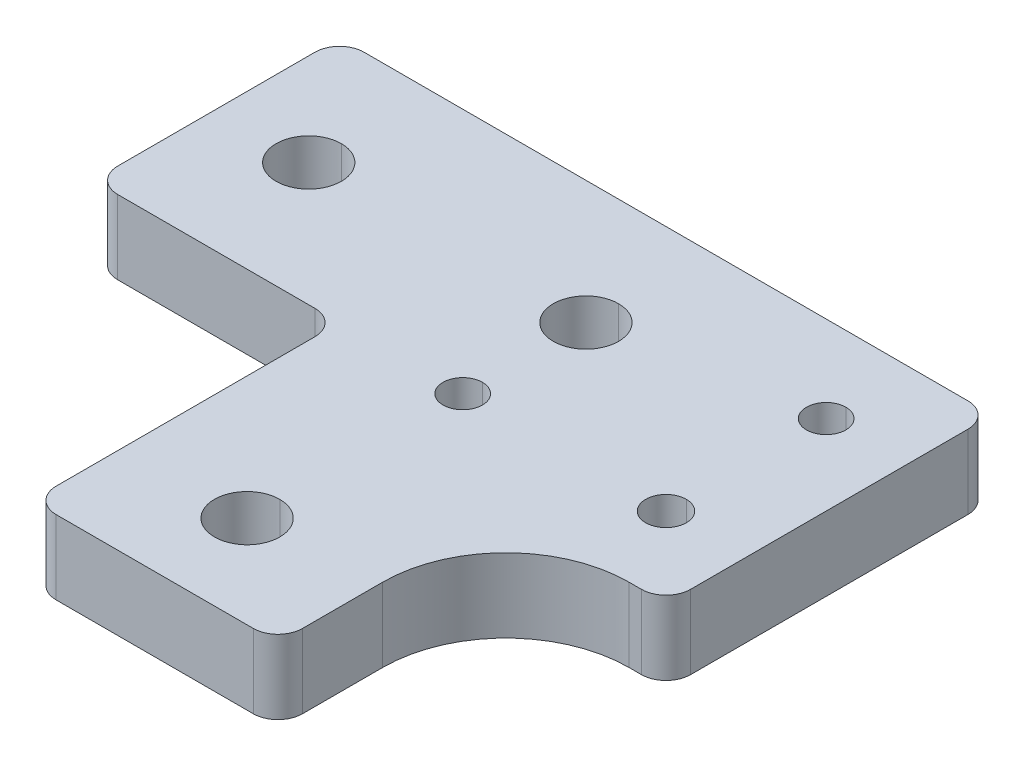
ISO-10303-21;
HEADER;
FILE_DESCRIPTION(('STEP AP214'),'2;1');
FILE_NAME('part.step','',(''),(''),'','','');
FILE_SCHEMA(('AUTOMOTIVE_DESIGN { 1 0 10303 214 1 1 1 1 }'));
ENDSEC;
DATA;
#1=APPLICATION_CONTEXT('core data for automotive mechanical design processes');
#2=APPLICATION_PROTOCOL_DEFINITION('international standard','automotive_design',2000,#1);
#3=PRODUCT_CONTEXT('',#1,'mechanical');
#4=PRODUCT('Part','Part','',(#3));
#5=PRODUCT_RELATED_PRODUCT_CATEGORY('part','',(#4));
#6=PRODUCT_DEFINITION_FORMATION('','',#4);
#7=PRODUCT_DEFINITION_CONTEXT('part definition',#1,'design');
#8=PRODUCT_DEFINITION('design','',#6,#7);
#9=PRODUCT_DEFINITION_SHAPE('','',#8);
#10=(LENGTH_UNIT() NAMED_UNIT(*) SI_UNIT(.MILLI.,.METRE.));
#11=(NAMED_UNIT(*) PLANE_ANGLE_UNIT() SI_UNIT($,.RADIAN.));
#12=(NAMED_UNIT(*) SI_UNIT($,.STERADIAN.) SOLID_ANGLE_UNIT());
#13=UNCERTAINTY_MEASURE_WITH_UNIT(LENGTH_MEASURE(1.E-05),#10,'distance_accuracy_value','');
#14=(GEOMETRIC_REPRESENTATION_CONTEXT(3) GLOBAL_UNCERTAINTY_ASSIGNED_CONTEXT((#13)) GLOBAL_UNIT_ASSIGNED_CONTEXT((#10,
#11,#12)) REPRESENTATION_CONTEXT('',''));
#15=CARTESIAN_POINT('',(0.,0.,0.));
#16=DIRECTION('',(0.,0.,1.));
#17=DIRECTION('',(1.,0.,0.));
#18=AXIS2_PLACEMENT_3D('',#15,#16,#17);
#19=CARTESIAN_POINT('',(99.5,6.,20.));
#20=DIRECTION('',(0.,1.,0.));
#21=DIRECTION('',(0.,0.,1.));
#22=AXIS2_PLACEMENT_3D('',#19,#20,#21);
#23=CYLINDRICAL_SURFACE('',#22,1.65);
#24=CARTESIAN_POINT('',(99.5,0.,20.));
#25=DIRECTION('',(0.,-1.,0.));
#26=DIRECTION('',(0.,0.,1.));
#27=AXIS2_PLACEMENT_3D('',#24,#25,#26);
#28=CIRCLE('',#27,1.65);
#29=CARTESIAN_POINT('',(99.5,0.,21.65));
#30=VERTEX_POINT('',#29);
#31=CARTESIAN_POINT('',(99.5,0.,18.35));
#32=VERTEX_POINT('',#31);
#33=EDGE_CURVE('E12',#30,#32,#28,.T.);
#34=ORIENTED_EDGE('',*,*,#33,.T.);
#35=DIRECTION('',(0.,1.,0.));
#36=VECTOR('',#35,1.);
#37=CARTESIAN_POINT('',(99.5,6.,18.35));
#38=LINE('',#37,#36);
#39=CARTESIAN_POINT('',(99.5,6.,18.35));
#40=VERTEX_POINT('',#39);
#41=EDGE_CURVE('E31',#32,#40,#38,.T.);
#42=ORIENTED_EDGE('',*,*,#41,.T.);
#43=CARTESIAN_POINT('',(99.5,6.,20.));
#44=DIRECTION('',(0.,-1.,0.));
#45=DIRECTION('',(0.,0.,1.));
#46=AXIS2_PLACEMENT_3D('',#43,#44,#45);
#47=CIRCLE('',#46,1.65);
#48=CARTESIAN_POINT('',(99.5,6.,21.65));
#49=VERTEX_POINT('',#48);
#50=EDGE_CURVE('E473',#49,#40,#47,.T.);
#51=ORIENTED_EDGE('',*,*,#50,.F.);
#52=DIRECTION('',(0.,1.,0.));
#53=VECTOR('',#52,1.);
#54=CARTESIAN_POINT('',(99.5,6.,21.65));
#55=LINE('',#54,#53);
#56=EDGE_CURVE('E411',#30,#49,#55,.T.);
#57=ORIENTED_EDGE('',*,*,#56,.F.);
#58=EDGE_LOOP('',(#34,#42,#51,#57));
#59=FACE_BOUND('',#58,.T.);
#60=ADVANCED_FACE('F20',(#59),#23,.F.);
#61=CARTESIAN_POINT('',(99.5,6.,7.));
#62=DIRECTION('',(0.,1.,0.));
#63=DIRECTION('',(0.,0.,1.));
#64=AXIS2_PLACEMENT_3D('',#61,#62,#63);
#65=CYLINDRICAL_SURFACE('',#64,1.6);
#66=CARTESIAN_POINT('',(99.5,0.,7.));
#67=DIRECTION('',(0.,-1.,0.));
#68=DIRECTION('',(0.,0.,1.));
#69=AXIS2_PLACEMENT_3D('',#66,#67,#68);
#70=CIRCLE('',#69,1.6);
#71=CARTESIAN_POINT('',(99.5,0.,8.6));
#72=VERTEX_POINT('',#71);
#73=CARTESIAN_POINT('',(99.5,0.,5.4));
#74=VERTEX_POINT('',#73);
#75=EDGE_CURVE('E438',#72,#74,#70,.T.);
#76=ORIENTED_EDGE('',*,*,#75,.T.);
#77=DIRECTION('',(0.,1.,0.));
#78=VECTOR('',#77,1.);
#79=CARTESIAN_POINT('',(99.5,6.,5.4));
#80=LINE('',#79,#78);
#81=CARTESIAN_POINT('',(99.5,6.,5.4));
#82=VERTEX_POINT('',#81);
#83=EDGE_CURVE('E387',#74,#82,#80,.T.);
#84=ORIENTED_EDGE('',*,*,#83,.T.);
#85=CARTESIAN_POINT('',(99.5,6.,7.));
#86=DIRECTION('',(0.,-1.,0.));
#87=DIRECTION('',(0.,0.,1.));
#88=AXIS2_PLACEMENT_3D('',#85,#86,#87);
#89=CIRCLE('',#88,1.6);
#90=CARTESIAN_POINT('',(99.5,6.,8.6));
#91=VERTEX_POINT('',#90);
#92=EDGE_CURVE('E532',#91,#82,#89,.T.);
#93=ORIENTED_EDGE('',*,*,#92,.F.);
#94=DIRECTION('',(0.,1.,0.));
#95=VECTOR('',#94,1.);
#96=CARTESIAN_POINT('',(99.5,6.,8.6));
#97=LINE('',#96,#95);
#98=EDGE_CURVE('E291',#72,#91,#97,.T.);
#99=ORIENTED_EDGE('',*,*,#98,.F.);
#100=EDGE_LOOP('',(#76,#84,#93,#99));
#101=FACE_BOUND('',#100,.T.);
#102=ADVANCED_FACE('F1234',(#101),#65,.F.);
#103=CARTESIAN_POINT('',(83.,6.,20.));
#104=DIRECTION('',(0.,1.,0.));
#105=DIRECTION('',(0.,0.,1.));
#106=AXIS2_PLACEMENT_3D('',#103,#104,#105);
#107=CYLINDRICAL_SURFACE('',#106,1.6);
#108=CARTESIAN_POINT('',(83.,0.,20.));
#109=DIRECTION('',(0.,-1.,0.));
#110=DIRECTION('',(0.,0.,1.));
#111=AXIS2_PLACEMENT_3D('',#108,#109,#110);
#112=CIRCLE('',#111,1.6);
#113=CARTESIAN_POINT('',(83.,0.,21.6));
#114=VERTEX_POINT('',#113);
#115=CARTESIAN_POINT('',(83.,0.,18.4));
#116=VERTEX_POINT('',#115);
#117=EDGE_CURVE('E382',#114,#116,#112,.T.);
#118=ORIENTED_EDGE('',*,*,#117,.T.);
#119=DIRECTION('',(0.,1.,0.));
#120=VECTOR('',#119,1.);
#121=CARTESIAN_POINT('',(83.,6.,18.4));
#122=LINE('',#121,#120);
#123=CARTESIAN_POINT('',(83.,6.,18.4));
#124=VERTEX_POINT('',#123);
#125=EDGE_CURVE('E388',#116,#124,#122,.T.);
#126=ORIENTED_EDGE('',*,*,#125,.T.);
#127=CARTESIAN_POINT('',(83.,6.,20.));
#128=DIRECTION('',(0.,-1.,0.));
#129=DIRECTION('',(0.,0.,1.));
#130=AXIS2_PLACEMENT_3D('',#127,#128,#129);
#131=CIRCLE('',#130,1.6);
#132=CARTESIAN_POINT('',(83.,6.,21.6));
#133=VERTEX_POINT('',#132);
#134=EDGE_CURVE('E579',#133,#124,#131,.T.);
#135=ORIENTED_EDGE('',*,*,#134,.F.);
#136=DIRECTION('',(0.,1.,0.));
#137=VECTOR('',#136,1.);
#138=CARTESIAN_POINT('',(83.,6.,21.6));
#139=LINE('',#138,#137);
#140=EDGE_CURVE('E517',#114,#133,#139,.T.);
#141=ORIENTED_EDGE('',*,*,#140,.F.);
#142=EDGE_LOOP('',(#118,#126,#135,#141));
#143=FACE_BOUND('',#142,.T.);
#144=ADVANCED_FACE('F1238',(#143),#107,.F.);
#145=CARTESIAN_POINT('',(83.,6.,37.5));
#146=DIRECTION('',(0.,-1.,0.));
#147=DIRECTION('',(0.,0.,-1.));
#148=AXIS2_PLACEMENT_3D('',#145,#146,#147);
#149=CYLINDRICAL_SURFACE('',#148,2.65);
#150=CARTESIAN_POINT('',(83.,6.,37.5));
#151=DIRECTION('',(0.,-1.,0.));
#152=DIRECTION('',(0.,0.,1.));
#153=AXIS2_PLACEMENT_3D('',#150,#151,#152);
#154=CIRCLE('',#153,2.65);
#155=CARTESIAN_POINT('',(83.,6.,40.15));
#156=VERTEX_POINT('',#155);
#157=CARTESIAN_POINT('',(83.,6.,34.85));
#158=VERTEX_POINT('',#157);
#159=EDGE_CURVE('E400',#156,#158,#154,.T.);
#160=ORIENTED_EDGE('',*,*,#159,.F.);
#161=DIRECTION('',(0.,-1.,0.));
#162=VECTOR('',#161,1.);
#163=CARTESIAN_POINT('',(83.,6.,40.15));
#164=LINE('',#163,#162);
#165=CARTESIAN_POINT('',(83.,0.,40.15));
#166=VERTEX_POINT('',#165);
#167=EDGE_CURVE('E378',#156,#166,#164,.T.);
#168=ORIENTED_EDGE('',*,*,#167,.T.);
#169=CARTESIAN_POINT('',(83.,0.,37.5));
#170=DIRECTION('',(0.,-1.,0.));
#171=DIRECTION('',(0.,0.,1.));
#172=AXIS2_PLACEMENT_3D('',#169,#170,#171);
#173=CIRCLE('',#172,2.65);
#174=CARTESIAN_POINT('',(83.,0.,34.85));
#175=VERTEX_POINT('',#174);
#176=EDGE_CURVE('E372',#166,#175,#173,.T.);
#177=ORIENTED_EDGE('',*,*,#176,.T.);
#178=DIRECTION('',(0.,-1.,0.));
#179=VECTOR('',#178,1.);
#180=CARTESIAN_POINT('',(83.,6.,34.85));
#181=LINE('',#180,#179);
#182=EDGE_CURVE('E361',#158,#175,#181,.T.);
#183=ORIENTED_EDGE('',*,*,#182,.F.);
#184=EDGE_LOOP('',(#160,#168,#177,#183));
#185=FACE_BOUND('',#184,.T.);
#186=ADVANCED_FACE('F22',(#185),#149,.F.);
#187=CARTESIAN_POINT('',(60.5,6.,10.));
#188=DIRECTION('',(0.,-1.,0.));
#189=DIRECTION('',(0.,0.,-1.));
#190=AXIS2_PLACEMENT_3D('',#187,#188,#189);
#191=CYLINDRICAL_SURFACE('',#190,2.65);
#192=CARTESIAN_POINT('',(60.5,6.,10.));
#193=DIRECTION('',(0.,-1.,0.));
#194=DIRECTION('',(0.,0.,1.));
#195=AXIS2_PLACEMENT_3D('',#192,#193,#194);
#196=CIRCLE('',#195,2.65);
#197=CARTESIAN_POINT('',(60.5,6.,12.65));
#198=VERTEX_POINT('',#197);
#199=CARTESIAN_POINT('',(60.5,6.,7.35));
#200=VERTEX_POINT('',#199);
#201=EDGE_CURVE('E585',#198,#200,#196,.T.);
#202=ORIENTED_EDGE('',*,*,#201,.F.);
#203=DIRECTION('',(0.,-1.,0.));
#204=VECTOR('',#203,1.);
#205=CARTESIAN_POINT('',(60.5,6.,12.65));
#206=LINE('',#205,#204);
#207=CARTESIAN_POINT('',(60.5,0.,12.65));
#208=VERTEX_POINT('',#207);
#209=EDGE_CURVE('E379',#198,#208,#206,.T.);
#210=ORIENTED_EDGE('',*,*,#209,.T.);
#211=CARTESIAN_POINT('',(60.5,0.,10.));
#212=DIRECTION('',(0.,-1.,0.));
#213=DIRECTION('',(0.,0.,1.));
#214=AXIS2_PLACEMENT_3D('',#211,#212,#213);
#215=CIRCLE('',#214,2.65);
#216=CARTESIAN_POINT('',(60.5,0.,7.35));
#217=VERTEX_POINT('',#216);
#218=EDGE_CURVE('E420',#208,#217,#215,.T.);
#219=ORIENTED_EDGE('',*,*,#218,.T.);
#220=DIRECTION('',(0.,-1.,0.));
#221=VECTOR('',#220,1.);
#222=CARTESIAN_POINT('',(60.5,6.,7.35));
#223=LINE('',#222,#221);
#224=EDGE_CURVE('E360',#200,#217,#223,.T.);
#225=ORIENTED_EDGE('',*,*,#224,.F.);
#226=EDGE_LOOP('',(#202,#210,#219,#225));
#227=FACE_BOUND('',#226,.T.);
#228=ADVANCED_FACE('F1216',(#227),#191,.F.);
#229=CARTESIAN_POINT('',(83.,6.,10.));
#230=DIRECTION('',(0.,-1.,0.));
#231=DIRECTION('',(0.,0.,-1.));
#232=AXIS2_PLACEMENT_3D('',#229,#230,#231);
#233=CYLINDRICAL_SURFACE('',#232,2.65);
#234=CARTESIAN_POINT('',(83.,6.,10.));
#235=DIRECTION('',(0.,-1.,0.));
#236=DIRECTION('',(0.,0.,1.));
#237=AXIS2_PLACEMENT_3D('',#234,#235,#236);
#238=CIRCLE('',#237,2.65);
#239=CARTESIAN_POINT('',(83.,6.,12.65));
#240=VERTEX_POINT('',#239);
#241=CARTESIAN_POINT('',(83.,6.,7.35));
#242=VERTEX_POINT('',#241);
#243=EDGE_CURVE('E551',#240,#242,#238,.T.);
#244=ORIENTED_EDGE('',*,*,#243,.F.);
#245=DIRECTION('',(0.,-1.,0.));
#246=VECTOR('',#245,1.);
#247=CARTESIAN_POINT('',(83.,6.,12.65));
#248=LINE('',#247,#246);
#249=CARTESIAN_POINT('',(83.,0.,12.65));
#250=VERTEX_POINT('',#249);
#251=EDGE_CURVE('E439',#240,#250,#248,.T.);
#252=ORIENTED_EDGE('',*,*,#251,.T.);
#253=CARTESIAN_POINT('',(83.,0.,10.));
#254=DIRECTION('',(0.,-1.,0.));
#255=DIRECTION('',(0.,0.,1.));
#256=AXIS2_PLACEMENT_3D('',#253,#254,#255);
#257=CIRCLE('',#256,2.65);
#258=CARTESIAN_POINT('',(83.,0.,7.35));
#259=VERTEX_POINT('',#258);
#260=EDGE_CURVE('E477',#250,#259,#257,.T.);
#261=ORIENTED_EDGE('',*,*,#260,.T.);
#262=DIRECTION('',(0.,-1.,0.));
#263=VECTOR('',#262,1.);
#264=CARTESIAN_POINT('',(83.,6.,7.35));
#265=LINE('',#264,#263);
#266=EDGE_CURVE('E468',#242,#259,#265,.T.);
#267=ORIENTED_EDGE('',*,*,#266,.F.);
#268=EDGE_LOOP('',(#244,#252,#261,#267));
#269=FACE_BOUND('',#268,.T.);
#270=ADVANCED_FACE('F1211',(#269),#233,.F.);
#271=CARTESIAN_POINT('',(106.,6.,0.));
#272=DIRECTION('',(0.,-1.,0.));
#273=DIRECTION('',(0.,0.,-1.));
#274=AXIS2_PLACEMENT_3D('',#271,#272,#273);
#275=PLANE('',#274);
#276=DIRECTION('',(1.,0.,0.));
#277=VECTOR('',#276,1.);
#278=CARTESIAN_POINT('',(106.,6.,0.));
#279=LINE('',#278,#277);
#280=CARTESIAN_POINT('',(55.,6.,0.));
#281=VERTEX_POINT('',#280);
#282=CARTESIAN_POINT('',(104.,6.,0.));
#283=VERTEX_POINT('',#282);
#284=EDGE_CURVE('E462',#281,#283,#279,.T.);
#285=ORIENTED_EDGE('',*,*,#284,.F.);
#286=CARTESIAN_POINT('',(55.,6.,2.));
#287=DIRECTION('',(0.,-1.,0.));
#288=DIRECTION('',(0.,0.,-1.));
#289=AXIS2_PLACEMENT_3D('',#286,#287,#288);
#290=CIRCLE('',#289,2.);
#291=CARTESIAN_POINT('',(53.,6.,2.));
#292=VERTEX_POINT('',#291);
#293=EDGE_CURVE('E330',#292,#281,#290,.T.);
#294=ORIENTED_EDGE('',*,*,#293,.F.);
#295=DIRECTION('',(0.,0.,-1.));
#296=VECTOR('',#295,1.);
#297=CARTESIAN_POINT('',(53.,6.,0.));
#298=LINE('',#297,#296);
#299=CARTESIAN_POINT('',(53.,6.,18.));
#300=VERTEX_POINT('',#299);
#301=EDGE_CURVE('E467',#300,#292,#298,.T.);
#302=ORIENTED_EDGE('',*,*,#301,.F.);
#303=CARTESIAN_POINT('',(55.,6.,18.));
#304=DIRECTION('',(0.,-1.,0.));
#305=DIRECTION('',(0.,0.,-1.));
#306=AXIS2_PLACEMENT_3D('',#303,#304,#305);
#307=CIRCLE('',#306,2.);
#308=CARTESIAN_POINT('',(55.,6.,20.));
#309=VERTEX_POINT('',#308);
#310=EDGE_CURVE('E479',#309,#300,#307,.T.);
#311=ORIENTED_EDGE('',*,*,#310,.F.);
#312=DIRECTION('',(-1.,0.,0.));
#313=VECTOR('',#312,1.);
#314=CARTESIAN_POINT('',(53.,6.,20.));
#315=LINE('',#314,#313);
#316=CARTESIAN_POINT('',(71.,6.,20.));
#317=VERTEX_POINT('',#316);
#318=EDGE_CURVE('E433',#317,#309,#315,.T.);
#319=ORIENTED_EDGE('',*,*,#318,.F.);
#320=CARTESIAN_POINT('',(71.,6.,22.));
#321=DIRECTION('',(0.,1.,0.));
#322=DIRECTION('',(0.,0.,-1.));
#323=AXIS2_PLACEMENT_3D('',#320,#321,#322);
#324=CIRCLE('',#323,2.);
#325=CARTESIAN_POINT('',(73.,6.,22.));
#326=VERTEX_POINT('',#325);
#327=EDGE_CURVE('E427',#326,#317,#324,.T.);
#328=ORIENTED_EDGE('',*,*,#327,.F.);
#329=DIRECTION('',(0.,0.,-1.));
#330=VECTOR('',#329,1.);
#331=CARTESIAN_POINT('',(73.,6.,20.));
#332=LINE('',#331,#330);
#333=CARTESIAN_POINT('',(73.,6.,43.));
#334=VERTEX_POINT('',#333);
#335=EDGE_CURVE('E428',#334,#326,#332,.T.);
#336=ORIENTED_EDGE('',*,*,#335,.F.);
#337=CARTESIAN_POINT('',(75.,6.,43.));
#338=DIRECTION('',(0.,-1.,0.));
#339=DIRECTION('',(0.,0.,-1.));
#340=AXIS2_PLACEMENT_3D('',#337,#338,#339);
#341=CIRCLE('',#340,2.);
#342=CARTESIAN_POINT('',(75.,6.,45.));
#343=VERTEX_POINT('',#342);
#344=EDGE_CURVE('E491',#343,#334,#341,.T.);
#345=ORIENTED_EDGE('',*,*,#344,.F.);
#346=DIRECTION('',(-1.,0.,0.));
#347=VECTOR('',#346,1.);
#348=CARTESIAN_POINT('',(93.,6.,45.));
#349=LINE('',#348,#347);
#350=CARTESIAN_POINT('',(91.,6.,45.));
#351=VERTEX_POINT('',#350);
#352=EDGE_CURVE('E432',#351,#343,#349,.T.);
#353=ORIENTED_EDGE('',*,*,#352,.F.);
#354=CARTESIAN_POINT('',(91.,6.,43.));
#355=DIRECTION('',(0.,-1.,0.));
#356=DIRECTION('',(0.,0.,-1.));
#357=AXIS2_PLACEMENT_3D('',#354,#355,#356);
#358=CIRCLE('',#357,2.);
#359=CARTESIAN_POINT('',(93.,6.,43.));
#360=VERTEX_POINT('',#359);
#361=EDGE_CURVE('E324',#360,#351,#358,.T.);
#362=ORIENTED_EDGE('',*,*,#361,.F.);
#363=DIRECTION('',(0.,0.,1.));
#364=VECTOR('',#363,1.);
#365=CARTESIAN_POINT('',(93.,6.,26.5));
#366=LINE('',#365,#364);
#367=CARTESIAN_POINT('',(93.,6.,36.5));
#368=VERTEX_POINT('',#367);
#369=EDGE_CURVE('E285',#368,#360,#366,.T.);
#370=ORIENTED_EDGE('',*,*,#369,.F.);
#371=CARTESIAN_POINT('',(103.,6.,36.5));
#372=DIRECTION('',(0.,1.,0.));
#373=DIRECTION('',(0.,0.,-1.));
#374=AXIS2_PLACEMENT_3D('',#371,#372,#373);
#375=CIRCLE('',#374,10.);
#376=CARTESIAN_POINT('',(103.,6.,26.5));
#377=VERTEX_POINT('',#376);
#378=EDGE_CURVE('E277',#377,#368,#375,.T.);
#379=ORIENTED_EDGE('',*,*,#378,.F.);
#380=DIRECTION('',(-1.,0.,0.));
#381=VECTOR('',#380,1.);
#382=CARTESIAN_POINT('',(106.,6.,26.5));
#383=LINE('',#382,#381);
#384=CARTESIAN_POINT('',(104.,6.,26.5));
#385=VERTEX_POINT('',#384);
#386=EDGE_CURVE('E282',#385,#377,#383,.T.);
#387=ORIENTED_EDGE('',*,*,#386,.F.);
#388=CARTESIAN_POINT('',(104.,6.,24.5));
#389=DIRECTION('',(0.,-1.,0.));
#390=DIRECTION('',(0.,0.,-1.));
#391=AXIS2_PLACEMENT_3D('',#388,#389,#390);
#392=CIRCLE('',#391,2.);
#393=CARTESIAN_POINT('',(106.,6.,24.5));
#394=VERTEX_POINT('',#393);
#395=EDGE_CURVE('E497',#394,#385,#392,.T.);
#396=ORIENTED_EDGE('',*,*,#395,.F.);
#397=DIRECTION('',(0.,0.,1.));
#398=VECTOR('',#397,1.);
#399=CARTESIAN_POINT('',(106.,6.,26.5));
#400=LINE('',#399,#398);
#401=CARTESIAN_POINT('',(106.,6.,2.));
#402=VERTEX_POINT('',#401);
#403=EDGE_CURVE('E301',#402,#394,#400,.T.);
#404=ORIENTED_EDGE('',*,*,#403,.F.);
#405=CARTESIAN_POINT('',(104.,6.,2.));
#406=DIRECTION('',(0.,-1.,0.));
#407=DIRECTION('',(0.,0.,-1.));
#408=AXIS2_PLACEMENT_3D('',#405,#406,#407);
#409=CIRCLE('',#408,2.);
#410=EDGE_CURVE('E307',#283,#402,#409,.T.);
#411=ORIENTED_EDGE('',*,*,#410,.F.);
#412=EDGE_LOOP('',(#285,#294,#302,#311,#319,#328,#336,#345,#353,#362,#370,#379,#387,#396,#404,#411));
#413=FACE_BOUND('',#412,.T.);
#414=ORIENTED_EDGE('',*,*,#50,.T.);
#415=CARTESIAN_POINT('',(99.5,6.,20.));
#416=DIRECTION('',(0.,-1.,0.));
#417=DIRECTION('',(0.,0.,1.));
#418=AXIS2_PLACEMENT_3D('',#415,#416,#417);
#419=CIRCLE('',#418,1.65);
#420=EDGE_CURVE('E478',#40,#49,#419,.T.);
#421=ORIENTED_EDGE('',*,*,#420,.T.);
#422=EDGE_LOOP('',(#414,#421));
#423=FACE_BOUND('',#422,.T.);
#424=ORIENTED_EDGE('',*,*,#92,.T.);
#425=CARTESIAN_POINT('',(99.5,6.,7.));
#426=DIRECTION('',(0.,-1.,0.));
#427=DIRECTION('',(0.,0.,1.));
#428=AXIS2_PLACEMENT_3D('',#425,#426,#427);
#429=CIRCLE('',#428,1.6);
#430=EDGE_CURVE('E584',#82,#91,#429,.T.);
#431=ORIENTED_EDGE('',*,*,#430,.T.);
#432=EDGE_LOOP('',(#424,#431));
#433=FACE_BOUND('',#432,.T.);
#434=ORIENTED_EDGE('',*,*,#134,.T.);
#435=CARTESIAN_POINT('',(83.,6.,20.));
#436=DIRECTION('',(0.,-1.,0.));
#437=DIRECTION('',(0.,0.,1.));
#438=AXIS2_PLACEMENT_3D('',#435,#436,#437);
#439=CIRCLE('',#438,1.6);
#440=EDGE_CURVE('E574',#124,#133,#439,.T.);
#441=ORIENTED_EDGE('',*,*,#440,.T.);
#442=EDGE_LOOP('',(#434,#441));
#443=FACE_BOUND('',#442,.T.);
#444=CARTESIAN_POINT('',(83.,6.,10.));
#445=DIRECTION('',(0.,-1.,0.));
#446=DIRECTION('',(0.,0.,1.));
#447=AXIS2_PLACEMENT_3D('',#444,#445,#446);
#448=CIRCLE('',#447,2.65);
#449=EDGE_CURVE('E556',#242,#240,#448,.T.);
#450=ORIENTED_EDGE('',*,*,#449,.T.);
#451=ORIENTED_EDGE('',*,*,#243,.T.);
#452=EDGE_LOOP('',(#450,#451));
#453=FACE_BOUND('',#452,.T.);
#454=CARTESIAN_POINT('',(60.5,6.,10.));
#455=DIRECTION('',(0.,-1.,0.));
#456=DIRECTION('',(0.,0.,1.));
#457=AXIS2_PLACEMENT_3D('',#454,#455,#456);
#458=CIRCLE('',#457,2.65);
#459=EDGE_CURVE('E353',#200,#198,#458,.T.);
#460=ORIENTED_EDGE('',*,*,#459,.T.);
#461=ORIENTED_EDGE('',*,*,#201,.T.);
#462=EDGE_LOOP('',(#460,#461));
#463=FACE_BOUND('',#462,.T.);
#464=CARTESIAN_POINT('',(83.,6.,37.5));
#465=DIRECTION('',(0.,-1.,0.));
#466=DIRECTION('',(0.,0.,1.));
#467=AXIS2_PLACEMENT_3D('',#464,#465,#466);
#468=CIRCLE('',#467,2.65);
#469=EDGE_CURVE('E362',#158,#156,#468,.T.);
#470=ORIENTED_EDGE('',*,*,#469,.T.);
#471=ORIENTED_EDGE('',*,*,#159,.T.);
#472=EDGE_LOOP('',(#470,#471));
#473=FACE_BOUND('',#472,.T.);
#474=ADVANCED_FACE('F280',(#413,#423,#433,#443,#453,#463,#473),#275,.F.);
#475=CARTESIAN_POINT('',(106.,0.,0.));
#476=DIRECTION('',(0.,-1.,0.));
#477=DIRECTION('',(0.,0.,-1.));
#478=AXIS2_PLACEMENT_3D('',#475,#476,#477);
#479=PLANE('',#478);
#480=DIRECTION('',(0.,0.,1.));
#481=VECTOR('',#480,1.);
#482=CARTESIAN_POINT('',(106.,0.,26.5));
#483=LINE('',#482,#481);
#484=CARTESIAN_POINT('',(106.,0.,2.));
#485=VERTEX_POINT('',#484);
#486=CARTESIAN_POINT('',(106.,0.,24.5));
#487=VERTEX_POINT('',#486);
#488=EDGE_CURVE('E380',#485,#487,#483,.T.);
#489=ORIENTED_EDGE('',*,*,#488,.T.);
#490=CARTESIAN_POINT('',(104.,0.,24.5));
#491=DIRECTION('',(0.,1.,0.));
#492=DIRECTION('',(0.,0.,-1.));
#493=AXIS2_PLACEMENT_3D('',#490,#491,#492);
#494=CIRCLE('',#493,2.);
#495=CARTESIAN_POINT('',(104.,0.,26.5));
#496=VERTEX_POINT('',#495);
#497=EDGE_CURVE('E455',#496,#487,#494,.T.);
#498=ORIENTED_EDGE('',*,*,#497,.F.);
#499=DIRECTION('',(-1.,0.,0.));
#500=VECTOR('',#499,1.);
#501=CARTESIAN_POINT('',(106.,0.,26.5));
#502=LINE('',#501,#500);
#503=CARTESIAN_POINT('',(103.,0.,26.5));
#504=VERTEX_POINT('',#503);
#505=EDGE_CURVE('E650',#496,#504,#502,.T.);
#506=ORIENTED_EDGE('',*,*,#505,.T.);
#507=CARTESIAN_POINT('',(103.,0.,36.5));
#508=DIRECTION('',(0.,-1.,0.));
#509=DIRECTION('',(0.,0.,-1.));
#510=AXIS2_PLACEMENT_3D('',#507,#508,#509);
#511=CIRCLE('',#510,10.);
#512=CARTESIAN_POINT('',(93.,0.,36.5));
#513=VERTEX_POINT('',#512);
#514=EDGE_CURVE('E304',#513,#504,#511,.T.);
#515=ORIENTED_EDGE('',*,*,#514,.F.);
#516=DIRECTION('',(0.,0.,1.));
#517=VECTOR('',#516,1.);
#518=CARTESIAN_POINT('',(93.,0.,26.5));
#519=LINE('',#518,#517);
#520=CARTESIAN_POINT('',(93.,0.,43.));
#521=VERTEX_POINT('',#520);
#522=EDGE_CURVE('E335',#513,#521,#519,.T.);
#523=ORIENTED_EDGE('',*,*,#522,.T.);
#524=CARTESIAN_POINT('',(91.,0.,43.));
#525=DIRECTION('',(0.,1.,0.));
#526=DIRECTION('',(0.,0.,-1.));
#527=AXIS2_PLACEMENT_3D('',#524,#525,#526);
#528=CIRCLE('',#527,2.);
#529=CARTESIAN_POINT('',(91.,0.,45.));
#530=VERTEX_POINT('',#529);
#531=EDGE_CURVE('E825',#530,#521,#528,.T.);
#532=ORIENTED_EDGE('',*,*,#531,.F.);
#533=DIRECTION('',(-1.,0.,0.));
#534=VECTOR('',#533,1.);
#535=CARTESIAN_POINT('',(93.,0.,45.));
#536=LINE('',#535,#534);
#537=CARTESIAN_POINT('',(75.,0.,45.));
#538=VERTEX_POINT('',#537);
#539=EDGE_CURVE('E331',#530,#538,#536,.T.);
#540=ORIENTED_EDGE('',*,*,#539,.T.);
#541=CARTESIAN_POINT('',(75.,0.,43.));
#542=DIRECTION('',(0.,1.,0.));
#543=DIRECTION('',(0.,0.,-1.));
#544=AXIS2_PLACEMENT_3D('',#541,#542,#543);
#545=CIRCLE('',#544,2.);
#546=CARTESIAN_POINT('',(73.,0.,43.));
#547=VERTEX_POINT('',#546);
#548=EDGE_CURVE('E323',#547,#538,#545,.T.);
#549=ORIENTED_EDGE('',*,*,#548,.F.);
#550=DIRECTION('',(0.,0.,-1.));
#551=VECTOR('',#550,1.);
#552=CARTESIAN_POINT('',(73.,0.,20.));
#553=LINE('',#552,#551);
#554=CARTESIAN_POINT('',(73.,0.,22.));
#555=VERTEX_POINT('',#554);
#556=EDGE_CURVE('E336',#547,#555,#553,.T.);
#557=ORIENTED_EDGE('',*,*,#556,.T.);
#558=CARTESIAN_POINT('',(71.,0.,22.));
#559=DIRECTION('',(0.,-1.,0.));
#560=DIRECTION('',(0.,0.,-1.));
#561=AXIS2_PLACEMENT_3D('',#558,#559,#560);
#562=CIRCLE('',#561,2.);
#563=CARTESIAN_POINT('',(71.,0.,20.));
#564=VERTEX_POINT('',#563);
#565=EDGE_CURVE('E101',#564,#555,#562,.T.);
#566=ORIENTED_EDGE('',*,*,#565,.F.);
#567=DIRECTION('',(-1.,0.,0.));
#568=VECTOR('',#567,1.);
#569=CARTESIAN_POINT('',(53.,0.,20.));
#570=LINE('',#569,#568);
#571=CARTESIAN_POINT('',(55.,0.,20.));
#572=VERTEX_POINT('',#571);
#573=EDGE_CURVE('E352',#564,#572,#570,.T.);
#574=ORIENTED_EDGE('',*,*,#573,.T.);
#575=CARTESIAN_POINT('',(55.,0.,18.));
#576=DIRECTION('',(0.,1.,0.));
#577=DIRECTION('',(0.,0.,-1.));
#578=AXIS2_PLACEMENT_3D('',#575,#576,#577);
#579=CIRCLE('',#578,2.);
#580=CARTESIAN_POINT('',(53.,0.,18.));
#581=VERTEX_POINT('',#580);
#582=EDGE_CURVE('E116',#581,#572,#579,.T.);
#583=ORIENTED_EDGE('',*,*,#582,.F.);
#584=DIRECTION('',(0.,0.,-1.));
#585=VECTOR('',#584,1.);
#586=CARTESIAN_POINT('',(53.,0.,0.));
#587=LINE('',#586,#585);
#588=CARTESIAN_POINT('',(53.,0.,2.));
#589=VERTEX_POINT('',#588);
#590=EDGE_CURVE('E622',#581,#589,#587,.T.);
#591=ORIENTED_EDGE('',*,*,#590,.T.);
#592=CARTESIAN_POINT('',(55.,0.,2.));
#593=DIRECTION('',(0.,1.,0.));
#594=DIRECTION('',(0.,0.,-1.));
#595=AXIS2_PLACEMENT_3D('',#592,#593,#594);
#596=CIRCLE('',#595,2.);
#597=CARTESIAN_POINT('',(55.,0.,0.));
#598=VERTEX_POINT('',#597);
#599=EDGE_CURVE('E538',#598,#589,#596,.T.);
#600=ORIENTED_EDGE('',*,*,#599,.F.);
#601=DIRECTION('',(1.,0.,0.));
#602=VECTOR('',#601,1.);
#603=CARTESIAN_POINT('',(106.,0.,0.));
#604=LINE('',#603,#602);
#605=CARTESIAN_POINT('',(104.,0.,0.));
#606=VERTEX_POINT('',#605);
#607=EDGE_CURVE('E410',#598,#606,#604,.T.);
#608=ORIENTED_EDGE('',*,*,#607,.T.);
#609=CARTESIAN_POINT('',(104.,0.,2.));
#610=DIRECTION('',(0.,1.,0.));
#611=DIRECTION('',(0.,0.,-1.));
#612=AXIS2_PLACEMENT_3D('',#609,#610,#611);
#613=CIRCLE('',#612,2.);
#614=EDGE_CURVE('E329',#485,#606,#613,.T.);
#615=ORIENTED_EDGE('',*,*,#614,.F.);
#616=EDGE_LOOP('',(#489,#498,#506,#515,#523,#532,#540,#549,#557,#566,#574,#583,#591,#600,#608,#615));
#617=FACE_BOUND('',#616,.T.);
#618=ORIENTED_EDGE('',*,*,#33,.F.);
#619=CARTESIAN_POINT('',(99.5,0.,20.));
#620=DIRECTION('',(0.,-1.,0.));
#621=DIRECTION('',(0.,0.,1.));
#622=AXIS2_PLACEMENT_3D('',#619,#620,#621);
#623=CIRCLE('',#622,1.65);
#624=EDGE_CURVE('E504',#32,#30,#623,.T.);
#625=ORIENTED_EDGE('',*,*,#624,.F.);
#626=EDGE_LOOP('',(#618,#625));
#627=FACE_BOUND('',#626,.T.);
#628=ORIENTED_EDGE('',*,*,#75,.F.);
#629=CARTESIAN_POINT('',(99.5,0.,7.));
#630=DIRECTION('',(0.,-1.,0.));
#631=DIRECTION('',(0.,0.,1.));
#632=AXIS2_PLACEMENT_3D('',#629,#630,#631);
#633=CIRCLE('',#632,1.6);
#634=EDGE_CURVE('E1169',#74,#72,#633,.T.);
#635=ORIENTED_EDGE('',*,*,#634,.F.);
#636=EDGE_LOOP('',(#628,#635));
#637=FACE_BOUND('',#636,.T.);
#638=ORIENTED_EDGE('',*,*,#117,.F.);
#639=CARTESIAN_POINT('',(83.,0.,20.));
#640=DIRECTION('',(0.,-1.,0.));
#641=DIRECTION('',(0.,0.,1.));
#642=AXIS2_PLACEMENT_3D('',#639,#640,#641);
#643=CIRCLE('',#642,1.6);
#644=EDGE_CURVE('E559',#116,#114,#643,.T.);
#645=ORIENTED_EDGE('',*,*,#644,.F.);
#646=EDGE_LOOP('',(#638,#645));
#647=FACE_BOUND('',#646,.T.);
#648=CARTESIAN_POINT('',(60.5,0.,10.));
#649=DIRECTION('',(0.,-1.,0.));
#650=DIRECTION('',(0.,0.,1.));
#651=AXIS2_PLACEMENT_3D('',#648,#649,#650);
#652=CIRCLE('',#651,2.65);
#653=EDGE_CURVE('E355',#217,#208,#652,.T.);
#654=ORIENTED_EDGE('',*,*,#653,.F.);
#655=ORIENTED_EDGE('',*,*,#218,.F.);
#656=EDGE_LOOP('',(#654,#655));
#657=FACE_BOUND('',#656,.T.);
#658=CARTESIAN_POINT('',(83.,0.,10.));
#659=DIRECTION('',(0.,-1.,0.));
#660=DIRECTION('',(0.,0.,1.));
#661=AXIS2_PLACEMENT_3D('',#658,#659,#660);
#662=CIRCLE('',#661,2.65);
#663=EDGE_CURVE('E610',#259,#250,#662,.T.);
#664=ORIENTED_EDGE('',*,*,#663,.F.);
#665=ORIENTED_EDGE('',*,*,#260,.F.);
#666=EDGE_LOOP('',(#664,#665));
#667=FACE_BOUND('',#666,.T.);
#668=CARTESIAN_POINT('',(83.,0.,37.5));
#669=DIRECTION('',(0.,-1.,0.));
#670=DIRECTION('',(0.,0.,1.));
#671=AXIS2_PLACEMENT_3D('',#668,#669,#670);
#672=CIRCLE('',#671,2.65);
#673=EDGE_CURVE('E545',#175,#166,#672,.T.);
#674=ORIENTED_EDGE('',*,*,#673,.F.);
#675=ORIENTED_EDGE('',*,*,#176,.F.);
#676=EDGE_LOOP('',(#674,#675));
#677=FACE_BOUND('',#676,.T.);
#678=ADVANCED_FACE('F683',(#617,#627,#637,#647,#657,#667,#677),#479,.T.);
#679=CARTESIAN_POINT('',(106.,6.,26.5));
#680=DIRECTION('',(-1.,0.,0.));
#681=DIRECTION('',(0.,0.,1.));
#682=AXIS2_PLACEMENT_3D('',#679,#680,#681);
#683=PLANE('',#682);
#684=ORIENTED_EDGE('',*,*,#403,.T.);
#685=DIRECTION('',(0.,1.,0.));
#686=VECTOR('',#685,1.);
#687=CARTESIAN_POINT('',(106.,6.,24.5));
#688=LINE('',#687,#686);
#689=EDGE_CURVE('E457',#487,#394,#688,.T.);
#690=ORIENTED_EDGE('',*,*,#689,.F.);
#691=ORIENTED_EDGE('',*,*,#488,.F.);
#692=DIRECTION('',(0.,-1.,0.));
#693=VECTOR('',#692,1.);
#694=CARTESIAN_POINT('',(106.,6.,2.));
#695=LINE('',#694,#693);
#696=EDGE_CURVE('E314',#402,#485,#695,.T.);
#697=ORIENTED_EDGE('',*,*,#696,.F.);
#698=EDGE_LOOP('',(#684,#690,#691,#697));
#699=FACE_BOUND('',#698,.T.);
#700=ADVANCED_FACE('F691',(#699),#683,.F.);
#701=CARTESIAN_POINT('',(106.,6.,26.5));
#702=DIRECTION('',(0.,0.,-1.));
#703=DIRECTION('',(0.,-1.,0.));
#704=AXIS2_PLACEMENT_3D('',#701,#702,#703);
#705=PLANE('',#704);
#706=ORIENTED_EDGE('',*,*,#386,.T.);
#707=DIRECTION('',(0.,1.,0.));
#708=VECTOR('',#707,1.);
#709=CARTESIAN_POINT('',(103.,6.,26.5));
#710=LINE('',#709,#708);
#711=EDGE_CURVE('E298',#504,#377,#710,.T.);
#712=ORIENTED_EDGE('',*,*,#711,.F.);
#713=ORIENTED_EDGE('',*,*,#505,.F.);
#714=DIRECTION('',(0.,-1.,0.));
#715=VECTOR('',#714,1.);
#716=CARTESIAN_POINT('',(104.,6.,26.5));
#717=LINE('',#716,#715);
#718=EDGE_CURVE('E24',#385,#496,#717,.T.);
#719=ORIENTED_EDGE('',*,*,#718,.F.);
#720=EDGE_LOOP('',(#706,#712,#713,#719));
#721=FACE_BOUND('',#720,.T.);
#722=ADVANCED_FACE('F296',(#721),#705,.F.);
#723=CARTESIAN_POINT('',(93.,6.,26.5));
#724=DIRECTION('',(-1.,0.,0.));
#725=DIRECTION('',(0.,0.,1.));
#726=AXIS2_PLACEMENT_3D('',#723,#724,#725);
#727=PLANE('',#726);
#728=ORIENTED_EDGE('',*,*,#522,.F.);
#729=DIRECTION('',(0.,-1.,0.));
#730=VECTOR('',#729,1.);
#731=CARTESIAN_POINT('',(93.,0.,36.5));
#732=LINE('',#731,#730);
#733=EDGE_CURVE('E292',#368,#513,#732,.T.);
#734=ORIENTED_EDGE('',*,*,#733,.F.);
#735=ORIENTED_EDGE('',*,*,#369,.T.);
#736=DIRECTION('',(0.,1.,0.));
#737=VECTOR('',#736,1.);
#738=CARTESIAN_POINT('',(93.,6.,43.));
#739=LINE('',#738,#737);
#740=EDGE_CURVE('E833',#521,#360,#739,.T.);
#741=ORIENTED_EDGE('',*,*,#740,.F.);
#742=EDGE_LOOP('',(#728,#734,#735,#741));
#743=FACE_BOUND('',#742,.T.);
#744=ADVANCED_FACE('F1227',(#743),#727,.F.);
#745=CARTESIAN_POINT('',(93.,6.,45.));
#746=DIRECTION('',(0.,0.,-1.));
#747=DIRECTION('',(0.,-1.,0.));
#748=AXIS2_PLACEMENT_3D('',#745,#746,#747);
#749=PLANE('',#748);
#750=ORIENTED_EDGE('',*,*,#539,.F.);
#751=DIRECTION('',(0.,-1.,0.));
#752=VECTOR('',#751,1.);
#753=CARTESIAN_POINT('',(91.,6.,45.));
#754=LINE('',#753,#752);
#755=EDGE_CURVE('E537',#351,#530,#754,.T.);
#756=ORIENTED_EDGE('',*,*,#755,.F.);
#757=ORIENTED_EDGE('',*,*,#352,.T.);
#758=DIRECTION('',(0.,1.,0.));
#759=VECTOR('',#758,1.);
#760=CARTESIAN_POINT('',(75.,6.,45.));
#761=LINE('',#760,#759);
#762=EDGE_CURVE('E319',#538,#343,#761,.T.);
#763=ORIENTED_EDGE('',*,*,#762,.F.);
#764=EDGE_LOOP('',(#750,#756,#757,#763));
#765=FACE_BOUND('',#764,.T.);
#766=ADVANCED_FACE('F1390',(#765),#749,.F.);
#767=CARTESIAN_POINT('',(73.,6.,20.));
#768=DIRECTION('',(1.,0.,0.));
#769=DIRECTION('',(0.,0.,1.));
#770=AXIS2_PLACEMENT_3D('',#767,#768,#769);
#771=PLANE('',#770);
#772=ORIENTED_EDGE('',*,*,#556,.F.);
#773=DIRECTION('',(0.,-1.,0.));
#774=VECTOR('',#773,1.);
#775=CARTESIAN_POINT('',(73.,6.,43.));
#776=LINE('',#775,#774);
#777=EDGE_CURVE('E496',#334,#547,#776,.T.);
#778=ORIENTED_EDGE('',*,*,#777,.F.);
#779=ORIENTED_EDGE('',*,*,#335,.T.);
#780=DIRECTION('',(0.,1.,0.));
#781=VECTOR('',#780,1.);
#782=CARTESIAN_POINT('',(73.,6.,22.));
#783=LINE('',#782,#781);
#784=EDGE_CURVE('E482',#555,#326,#783,.T.);
#785=ORIENTED_EDGE('',*,*,#784,.F.);
#786=EDGE_LOOP('',(#772,#778,#779,#785));
#787=FACE_BOUND('',#786,.T.);
#788=ADVANCED_FACE('F1394',(#787),#771,.F.);
#789=CARTESIAN_POINT('',(53.,6.,20.));
#790=DIRECTION('',(0.,0.,-1.));
#791=DIRECTION('',(0.,-1.,0.));
#792=AXIS2_PLACEMENT_3D('',#789,#790,#791);
#793=PLANE('',#792);
#794=ORIENTED_EDGE('',*,*,#318,.T.);
#795=DIRECTION('',(0.,1.,0.));
#796=VECTOR('',#795,1.);
#797=CARTESIAN_POINT('',(55.,6.,20.));
#798=LINE('',#797,#796);
#799=EDGE_CURVE('E495',#572,#309,#798,.T.);
#800=ORIENTED_EDGE('',*,*,#799,.F.);
#801=ORIENTED_EDGE('',*,*,#573,.F.);
#802=DIRECTION('',(0.,-1.,0.));
#803=VECTOR('',#802,1.);
#804=CARTESIAN_POINT('',(71.,0.,20.));
#805=LINE('',#804,#803);
#806=EDGE_CURVE('E423',#317,#564,#805,.T.);
#807=ORIENTED_EDGE('',*,*,#806,.F.);
#808=EDGE_LOOP('',(#794,#800,#801,#807));
#809=FACE_BOUND('',#808,.T.);
#810=ADVANCED_FACE('F1272',(#809),#793,.F.);
#811=CARTESIAN_POINT('',(53.,6.,0.));
#812=DIRECTION('',(1.,0.,0.));
#813=DIRECTION('',(0.,1.,0.));
#814=AXIS2_PLACEMENT_3D('',#811,#812,#813);
#815=PLANE('',#814);
#816=ORIENTED_EDGE('',*,*,#590,.F.);
#817=DIRECTION('',(0.,-1.,0.));
#818=VECTOR('',#817,1.);
#819=CARTESIAN_POINT('',(53.,6.,18.));
#820=LINE('',#819,#818);
#821=EDGE_CURVE('E483',#300,#581,#820,.T.);
#822=ORIENTED_EDGE('',*,*,#821,.F.);
#823=ORIENTED_EDGE('',*,*,#301,.T.);
#824=DIRECTION('',(0.,1.,0.));
#825=VECTOR('',#824,1.);
#826=CARTESIAN_POINT('',(53.,6.,2.));
#827=LINE('',#826,#825);
#828=EDGE_CURVE('E541',#589,#292,#827,.T.);
#829=ORIENTED_EDGE('',*,*,#828,.F.);
#830=EDGE_LOOP('',(#816,#822,#823,#829));
#831=FACE_BOUND('',#830,.T.);
#832=ADVANCED_FACE('F665',(#831),#815,.F.);
#833=CARTESIAN_POINT('',(106.,6.,0.));
#834=DIRECTION('',(0.,0.,1.));
#835=DIRECTION('',(1.,0.,0.));
#836=AXIS2_PLACEMENT_3D('',#833,#834,#835);
#837=PLANE('',#836);
#838=ORIENTED_EDGE('',*,*,#607,.F.);
#839=DIRECTION('',(0.,-1.,0.));
#840=VECTOR('',#839,1.);
#841=CARTESIAN_POINT('',(55.,6.,0.));
#842=LINE('',#841,#840);
#843=EDGE_CURVE('E501',#281,#598,#842,.T.);
#844=ORIENTED_EDGE('',*,*,#843,.F.);
#845=ORIENTED_EDGE('',*,*,#284,.T.);
#846=DIRECTION('',(0.,1.,0.));
#847=VECTOR('',#846,1.);
#848=CARTESIAN_POINT('',(104.,6.,0.));
#849=LINE('',#848,#847);
#850=EDGE_CURVE('E325',#606,#283,#849,.T.);
#851=ORIENTED_EDGE('',*,*,#850,.F.);
#852=EDGE_LOOP('',(#838,#844,#845,#851));
#853=FACE_BOUND('',#852,.T.);
#854=ADVANCED_FACE('F680',(#853),#837,.F.);
#855=CARTESIAN_POINT('',(83.,6.,10.));
#856=DIRECTION('',(0.,-1.,0.));
#857=DIRECTION('',(0.,0.,-1.));
#858=AXIS2_PLACEMENT_3D('',#855,#856,#857);
#859=CYLINDRICAL_SURFACE('',#858,2.65);
#860=ORIENTED_EDGE('',*,*,#251,.F.);
#861=ORIENTED_EDGE('',*,*,#449,.F.);
#862=ORIENTED_EDGE('',*,*,#266,.T.);
#863=ORIENTED_EDGE('',*,*,#663,.T.);
#864=EDGE_LOOP('',(#860,#861,#862,#863));
#865=FACE_BOUND('',#864,.T.);
#866=ADVANCED_FACE('F1250',(#865),#859,.F.);
#867=CARTESIAN_POINT('',(60.5,6.,10.));
#868=DIRECTION('',(0.,-1.,0.));
#869=DIRECTION('',(0.,0.,-1.));
#870=AXIS2_PLACEMENT_3D('',#867,#868,#869);
#871=CYLINDRICAL_SURFACE('',#870,2.65);
#872=ORIENTED_EDGE('',*,*,#209,.F.);
#873=ORIENTED_EDGE('',*,*,#459,.F.);
#874=ORIENTED_EDGE('',*,*,#224,.T.);
#875=ORIENTED_EDGE('',*,*,#653,.T.);
#876=EDGE_LOOP('',(#872,#873,#874,#875));
#877=FACE_BOUND('',#876,.T.);
#878=ADVANCED_FACE('F1246',(#877),#871,.F.);
#879=CARTESIAN_POINT('',(83.,6.,37.5));
#880=DIRECTION('',(0.,-1.,0.));
#881=DIRECTION('',(0.,0.,-1.));
#882=AXIS2_PLACEMENT_3D('',#879,#880,#881);
#883=CYLINDRICAL_SURFACE('',#882,2.65);
#884=ORIENTED_EDGE('',*,*,#167,.F.);
#885=ORIENTED_EDGE('',*,*,#469,.F.);
#886=ORIENTED_EDGE('',*,*,#182,.T.);
#887=ORIENTED_EDGE('',*,*,#673,.T.);
#888=EDGE_LOOP('',(#884,#885,#886,#887));
#889=FACE_BOUND('',#888,.T.);
#890=ADVANCED_FACE('F601',(#889),#883,.F.);
#891=CARTESIAN_POINT('',(83.,6.,20.));
#892=DIRECTION('',(0.,1.,0.));
#893=DIRECTION('',(0.,0.,1.));
#894=AXIS2_PLACEMENT_3D('',#891,#892,#893);
#895=CYLINDRICAL_SURFACE('',#894,1.6);
#896=ORIENTED_EDGE('',*,*,#125,.F.);
#897=ORIENTED_EDGE('',*,*,#644,.T.);
#898=ORIENTED_EDGE('',*,*,#140,.T.);
#899=ORIENTED_EDGE('',*,*,#440,.F.);
#900=EDGE_LOOP('',(#896,#897,#898,#899));
#901=FACE_BOUND('',#900,.T.);
#902=ADVANCED_FACE('F1279',(#901),#895,.F.);
#903=CARTESIAN_POINT('',(99.5,6.,7.));
#904=DIRECTION('',(0.,1.,0.));
#905=DIRECTION('',(0.,0.,1.));
#906=AXIS2_PLACEMENT_3D('',#903,#904,#905);
#907=CYLINDRICAL_SURFACE('',#906,1.6);
#908=ORIENTED_EDGE('',*,*,#83,.F.);
#909=ORIENTED_EDGE('',*,*,#634,.T.);
#910=ORIENTED_EDGE('',*,*,#98,.T.);
#911=ORIENTED_EDGE('',*,*,#430,.F.);
#912=EDGE_LOOP('',(#908,#909,#910,#911));
#913=FACE_BOUND('',#912,.T.);
#914=ADVANCED_FACE('F1283',(#913),#907,.F.);
#915=CARTESIAN_POINT('',(103.,6.,36.5));
#916=DIRECTION('',(0.,1.,0.));
#917=DIRECTION('',(0.,0.,1.));
#918=AXIS2_PLACEMENT_3D('',#915,#916,#917);
#919=CYLINDRICAL_SURFACE('',#918,10.);
#920=ORIENTED_EDGE('',*,*,#378,.T.);
#921=ORIENTED_EDGE('',*,*,#733,.T.);
#922=ORIENTED_EDGE('',*,*,#514,.T.);
#923=ORIENTED_EDGE('',*,*,#711,.T.);
#924=EDGE_LOOP('',(#920,#921,#922,#923));
#925=FACE_BOUND('',#924,.T.);
#926=ADVANCED_FACE('F303',(#925),#919,.F.);
#927=CARTESIAN_POINT('',(104.,6.,2.));
#928=DIRECTION('',(0.,-1.,0.));
#929=DIRECTION('',(0.,0.,-1.));
#930=AXIS2_PLACEMENT_3D('',#927,#928,#929);
#931=CYLINDRICAL_SURFACE('',#930,2.);
#932=ORIENTED_EDGE('',*,*,#410,.T.);
#933=ORIENTED_EDGE('',*,*,#696,.T.);
#934=ORIENTED_EDGE('',*,*,#614,.T.);
#935=ORIENTED_EDGE('',*,*,#850,.T.);
#936=EDGE_LOOP('',(#932,#933,#934,#935));
#937=FACE_BOUND('',#936,.T.);
#938=ADVANCED_FACE('F693',(#937),#931,.T.);
#939=CARTESIAN_POINT('',(55.,6.,2.));
#940=DIRECTION('',(0.,-1.,0.));
#941=DIRECTION('',(0.,0.,-1.));
#942=AXIS2_PLACEMENT_3D('',#939,#940,#941);
#943=CYLINDRICAL_SURFACE('',#942,2.);
#944=ORIENTED_EDGE('',*,*,#293,.T.);
#945=ORIENTED_EDGE('',*,*,#843,.T.);
#946=ORIENTED_EDGE('',*,*,#599,.T.);
#947=ORIENTED_EDGE('',*,*,#828,.T.);
#948=EDGE_LOOP('',(#944,#945,#946,#947));
#949=FACE_BOUND('',#948,.T.);
#950=ADVANCED_FACE('F667',(#949),#943,.T.);
#951=CARTESIAN_POINT('',(71.,6.,22.));
#952=DIRECTION('',(0.,1.,0.));
#953=DIRECTION('',(0.,0.,1.));
#954=AXIS2_PLACEMENT_3D('',#951,#952,#953);
#955=CYLINDRICAL_SURFACE('',#954,2.);
#956=ORIENTED_EDGE('',*,*,#327,.T.);
#957=ORIENTED_EDGE('',*,*,#806,.T.);
#958=ORIENTED_EDGE('',*,*,#565,.T.);
#959=ORIENTED_EDGE('',*,*,#784,.T.);
#960=EDGE_LOOP('',(#956,#957,#958,#959));
#961=FACE_BOUND('',#960,.T.);
#962=ADVANCED_FACE('F1321',(#961),#955,.F.);
#963=CARTESIAN_POINT('',(55.,6.,18.));
#964=DIRECTION('',(0.,-1.,0.));
#965=DIRECTION('',(0.,0.,-1.));
#966=AXIS2_PLACEMENT_3D('',#963,#964,#965);
#967=CYLINDRICAL_SURFACE('',#966,2.);
#968=ORIENTED_EDGE('',*,*,#310,.T.);
#969=ORIENTED_EDGE('',*,*,#821,.T.);
#970=ORIENTED_EDGE('',*,*,#582,.T.);
#971=ORIENTED_EDGE('',*,*,#799,.T.);
#972=EDGE_LOOP('',(#968,#969,#970,#971));
#973=FACE_BOUND('',#972,.T.);
#974=ADVANCED_FACE('F1353',(#973),#967,.T.);
#975=CARTESIAN_POINT('',(75.,6.,43.));
#976=DIRECTION('',(0.,-1.,0.));
#977=DIRECTION('',(0.,0.,-1.));
#978=AXIS2_PLACEMENT_3D('',#975,#976,#977);
#979=CYLINDRICAL_SURFACE('',#978,2.);
#980=ORIENTED_EDGE('',*,*,#344,.T.);
#981=ORIENTED_EDGE('',*,*,#777,.T.);
#982=ORIENTED_EDGE('',*,*,#548,.T.);
#983=ORIENTED_EDGE('',*,*,#762,.T.);
#984=EDGE_LOOP('',(#980,#981,#982,#983));
#985=FACE_BOUND('',#984,.T.);
#986=ADVANCED_FACE('F1349',(#985),#979,.T.);
#987=CARTESIAN_POINT('',(91.,6.,43.));
#988=DIRECTION('',(0.,-1.,0.));
#989=DIRECTION('',(0.,0.,-1.));
#990=AXIS2_PLACEMENT_3D('',#987,#988,#989);
#991=CYLINDRICAL_SURFACE('',#990,2.);
#992=ORIENTED_EDGE('',*,*,#361,.T.);
#993=ORIENTED_EDGE('',*,*,#755,.T.);
#994=ORIENTED_EDGE('',*,*,#531,.T.);
#995=ORIENTED_EDGE('',*,*,#740,.T.);
#996=EDGE_LOOP('',(#992,#993,#994,#995));
#997=FACE_BOUND('',#996,.T.);
#998=ADVANCED_FACE('F1342',(#997),#991,.T.);
#999=CARTESIAN_POINT('',(104.,6.,24.5));
#1000=DIRECTION('',(0.,-1.,0.));
#1001=DIRECTION('',(0.,0.,-1.));
#1002=AXIS2_PLACEMENT_3D('',#999,#1000,#1001);
#1003=CYLINDRICAL_SURFACE('',#1002,2.);
#1004=ORIENTED_EDGE('',*,*,#395,.T.);
#1005=ORIENTED_EDGE('',*,*,#718,.T.);
#1006=ORIENTED_EDGE('',*,*,#497,.T.);
#1007=ORIENTED_EDGE('',*,*,#689,.T.);
#1008=EDGE_LOOP('',(#1004,#1005,#1006,#1007));
#1009=FACE_BOUND('',#1008,.T.);
#1010=ADVANCED_FACE('F1337',(#1009),#1003,.T.);
#1011=CARTESIAN_POINT('',(99.5,6.,20.));
#1012=DIRECTION('',(0.,1.,0.));
#1013=DIRECTION('',(0.,0.,1.));
#1014=AXIS2_PLACEMENT_3D('',#1011,#1012,#1013);
#1015=CYLINDRICAL_SURFACE('',#1014,1.65);
#1016=ORIENTED_EDGE('',*,*,#41,.F.);
#1017=ORIENTED_EDGE('',*,*,#624,.T.);
#1018=ORIENTED_EDGE('',*,*,#56,.T.);
#1019=ORIENTED_EDGE('',*,*,#420,.F.);
#1020=EDGE_LOOP('',(#1016,#1017,#1018,#1019));
#1021=FACE_BOUND('',#1020,.T.);
#1022=ADVANCED_FACE('F1341',(#1021),#1015,.F.);
#1023=CLOSED_SHELL('',(#60,#102,#144,#186,#228,#270,#474,#678,#700,#722,#744,#766,#788,#810,
#832,#854,#866,#878,#890,#902,#914,#926,#938,#950,#962,#974,#986,#998,#1010,#1022));
#1024=MANIFOLD_SOLID_BREP('B1',#1023);
#1025=ADVANCED_BREP_SHAPE_REPRESENTATION('',(#18,#1024),#14);
#1026=SHAPE_DEFINITION_REPRESENTATION(#9,#1025);
ENDSEC;
END-ISO-10303-21;
